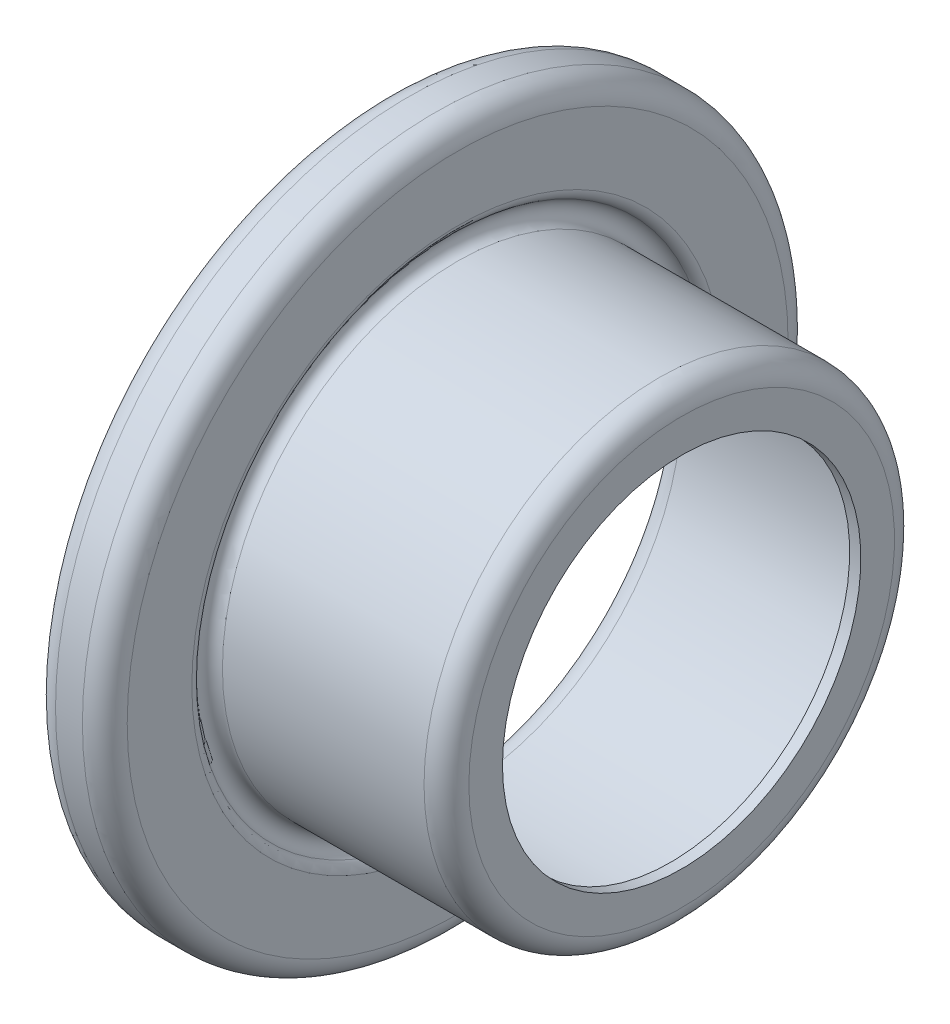
ISO-10303-21;
HEADER;
FILE_DESCRIPTION(('STEP AP214'),'2;1');
FILE_NAME('part.step','',(''),(''),'','','');
FILE_SCHEMA(('AUTOMOTIVE_DESIGN { 1 0 10303 214 1 1 1 1 }'));
ENDSEC;
DATA;
#1=APPLICATION_CONTEXT('core data for automotive mechanical design processes');
#2=APPLICATION_PROTOCOL_DEFINITION('international standard','automotive_design',2000,#1);
#3=PRODUCT_CONTEXT('',#1,'mechanical');
#4=PRODUCT('Part','Part','',(#3));
#5=PRODUCT_RELATED_PRODUCT_CATEGORY('part','',(#4));
#6=PRODUCT_DEFINITION_FORMATION('','',#4);
#7=PRODUCT_DEFINITION_CONTEXT('part definition',#1,'design');
#8=PRODUCT_DEFINITION('design','',#6,#7);
#9=PRODUCT_DEFINITION_SHAPE('','',#8);
#10=(LENGTH_UNIT() NAMED_UNIT(*) SI_UNIT(.MILLI.,.METRE.));
#11=(NAMED_UNIT(*) PLANE_ANGLE_UNIT() SI_UNIT($,.RADIAN.));
#12=(NAMED_UNIT(*) SI_UNIT($,.STERADIAN.) SOLID_ANGLE_UNIT());
#13=UNCERTAINTY_MEASURE_WITH_UNIT(LENGTH_MEASURE(1.E-05),#10,'distance_accuracy_value','');
#14=(GEOMETRIC_REPRESENTATION_CONTEXT(3) GLOBAL_UNCERTAINTY_ASSIGNED_CONTEXT((#13)) GLOBAL_UNIT_ASSIGNED_CONTEXT((#10,
#11,#12)) REPRESENTATION_CONTEXT('',''));
#15=CARTESIAN_POINT('',(0.,0.,0.));
#16=DIRECTION('',(0.,0.,1.));
#17=DIRECTION('',(1.,0.,0.));
#18=AXIS2_PLACEMENT_3D('',#15,#16,#17);
#19=CARTESIAN_POINT('',(-13.2,14.75,0.));
#20=DIRECTION('',(1.00000000000001,0.,0.));
#21=DIRECTION('',(0.,0.,-1.00000000000001));
#22=AXIS2_PLACEMENT_3D('',#19,#20,#21);
#23=PLANE('',#22);
#24=CARTESIAN_POINT('',(-13.2,0.,0.));
#25=DIRECTION('',(-1.00000000000001,0.,0.));
#26=DIRECTION('',(0.,0.,1.00000000000001));
#27=AXIS2_PLACEMENT_3D('',#24,#25,#26);
#28=CIRCLE('',#27,14.);
#29=CARTESIAN_POINT('',(-13.2,0.,14.));
#30=VERTEX_POINT('',#29);
#31=EDGE_CURVE('E10',#30,#30,#28,.T.);
#32=ORIENTED_EDGE('',*,*,#31,.F.);
#33=EDGE_LOOP('',(#32));
#34=FACE_BOUND('',#33,.T.);
#35=CARTESIAN_POINT('',(-13.2,0.,0.));
#36=DIRECTION('',(-1.00000000000001,0.,0.));
#37=DIRECTION('',(0.,0.,1.00000000000001));
#38=AXIS2_PLACEMENT_3D('',#35,#36,#37);
#39=CIRCLE('',#38,14.75);
#40=CARTESIAN_POINT('',(-13.2,0.,14.75));
#41=VERTEX_POINT('',#40);
#42=EDGE_CURVE('E115',#41,#41,#39,.T.);
#43=ORIENTED_EDGE('',*,*,#42,.T.);
#44=EDGE_LOOP('',(#43));
#45=FACE_BOUND('',#44,.T.);
#46=ADVANCED_FACE('F38',(#34,#45),#23,.F.);
#47=CARTESIAN_POINT('',(-70.0000000000004,0.,0.));
#48=DIRECTION('',(-1.00000000000001,0.,0.));
#49=DIRECTION('',(0.,0.,1.00000000000001));
#50=AXIS2_PLACEMENT_3D('',#47,#48,#49);
#51=CYLINDRICAL_SURFACE('',#50,14.);
#52=CARTESIAN_POINT('',(-12.9,0.,0.));
#53=DIRECTION('',(1.00000000000001,0.,0.));
#54=DIRECTION('',(0.,0.,-1.00000000000001));
#55=AXIS2_PLACEMENT_3D('',#52,#53,#54);
#56=CIRCLE('',#55,14.);
#57=CARTESIAN_POINT('',(-12.9,0.,-14.0000000000001));
#58=VERTEX_POINT('',#57);
#59=EDGE_CURVE('E127',#58,#58,#56,.T.);
#60=ORIENTED_EDGE('',*,*,#59,.T.);
#61=EDGE_LOOP('',(#60));
#62=FACE_BOUND('',#61,.T.);
#63=ORIENTED_EDGE('',*,*,#31,.T.);
#64=EDGE_LOOP('',(#63));
#65=FACE_BOUND('',#64,.T.);
#66=ADVANCED_FACE('F133',(#62,#65),#51,.F.);
#67=CARTESIAN_POINT('',(-70.0000000000004,0.,0.));
#68=DIRECTION('',(-1.00000000000001,0.,0.));
#69=DIRECTION('',(0.,0.,1.00000000000001));
#70=AXIS2_PLACEMENT_3D('',#67,#68,#69);
#71=CYLINDRICAL_SURFACE('',#70,15.25);
#72=CARTESIAN_POINT('',(-11.,0.,0.));
#73=DIRECTION('',(-1.00000000000001,0.,0.));
#74=DIRECTION('',(0.,0.,1.00000000000001));
#75=AXIS2_PLACEMENT_3D('',#72,#73,#74);
#76=CIRCLE('',#75,15.25);
#77=CARTESIAN_POINT('',(-11.,0.,15.25));
#78=VERTEX_POINT('',#77);
#79=EDGE_CURVE('E45',#78,#78,#76,.T.);
#80=ORIENTED_EDGE('',*,*,#79,.F.);
#81=EDGE_LOOP('',(#80));
#82=FACE_BOUND('',#81,.T.);
#83=CARTESIAN_POINT('',(-12.4,0.,0.));
#84=DIRECTION('',(1.00000000000001,0.,0.));
#85=DIRECTION('',(0.,0.,-1.00000000000001));
#86=AXIS2_PLACEMENT_3D('',#83,#84,#85);
#87=CIRCLE('',#86,15.25);
#88=CARTESIAN_POINT('',(-12.4,0.,-15.2500000000001));
#89=VERTEX_POINT('',#88);
#90=EDGE_CURVE('E119',#89,#89,#87,.T.);
#91=ORIENTED_EDGE('',*,*,#90,.F.);
#92=EDGE_LOOP('',(#91));
#93=FACE_BOUND('',#92,.T.);
#94=ADVANCED_FACE('F148',(#82,#93),#71,.F.);
#95=CARTESIAN_POINT('',(-11.,0.,0.));
#96=DIRECTION('',(-1.00000000000001,0.,0.));
#97=DIRECTION('',(0.,0.,1.00000000000001));
#98=AXIS2_PLACEMENT_3D('',#95,#96,#97);
#99=TOROIDAL_SURFACE('',#98,14.75,0.5);
#100=ORIENTED_EDGE('',*,*,#79,.T.);
#101=EDGE_LOOP('',(#100));
#102=FACE_BOUND('',#101,.T.);
#103=CARTESIAN_POINT('',(-10.5,0.,-1.52655665885959E-13));
#104=DIRECTION('',(-1.00000000000001,0.,0.));
#105=DIRECTION('',(0.,0.,1.00000000000001));
#106=AXIS2_PLACEMENT_3D('',#103,#104,#105);
#107=CIRCLE('',#106,14.75);
#108=CARTESIAN_POINT('',(-10.5,0.,14.7499999999999));
#109=VERTEX_POINT('',#108);
#110=EDGE_CURVE('E51',#109,#109,#107,.T.);
#111=ORIENTED_EDGE('',*,*,#110,.F.);
#112=EDGE_LOOP('',(#111));
#113=FACE_BOUND('',#112,.T.);
#114=ADVANCED_FACE('F150',(#102,#113),#99,.F.);
#115=CARTESIAN_POINT('',(-10.5,11.8660254037844,0.));
#116=DIRECTION('',(-1.00000000000001,0.,0.));
#117=DIRECTION('',(0.,0.,1.00000000000001));
#118=AXIS2_PLACEMENT_3D('',#115,#116,#117);
#119=PLANE('',#118);
#120=ORIENTED_EDGE('',*,*,#110,.T.);
#121=EDGE_LOOP('',(#120));
#122=FACE_BOUND('',#121,.T.);
#123=CARTESIAN_POINT('',(-10.5,0.,-1.52655665885959E-13));
#124=DIRECTION('',(-1.00000000000001,0.,0.));
#125=DIRECTION('',(0.,0.,1.00000000000001));
#126=AXIS2_PLACEMENT_3D('',#123,#124,#125);
#127=CIRCLE('',#126,11.8660254037844);
#128=CARTESIAN_POINT('',(-10.5,0.,11.8660254037843));
#129=VERTEX_POINT('',#128);
#130=EDGE_CURVE('E57',#129,#129,#127,.T.);
#131=ORIENTED_EDGE('',*,*,#130,.F.);
#132=EDGE_LOOP('',(#131));
#133=FACE_BOUND('',#132,.T.);
#134=ADVANCED_FACE('F157',(#122,#133),#119,.T.);
#135=CARTESIAN_POINT('',(-10.0000000000001,0.,-1.11022302462516E-13));
#136=DIRECTION('',(-1.00000000000001,0.,0.));
#137=DIRECTION('',(0.,0.,1.00000000000001));
#138=AXIS2_PLACEMENT_3D('',#135,#136,#137);
#139=TOROIDAL_SURFACE('',#138,11.,1.);
#140=ORIENTED_EDGE('',*,*,#130,.T.);
#141=EDGE_LOOP('',(#140));
#142=FACE_BOUND('',#141,.T.);
#143=CARTESIAN_POINT('',(-10.0000000000001,0.,-1.11022302462516E-13));
#144=DIRECTION('',(-1.00000000000001,0.,0.));
#145=DIRECTION('',(0.,0.,1.00000000000001));
#146=AXIS2_PLACEMENT_3D('',#143,#144,#145);
#147=CIRCLE('',#146,10.);
#148=CARTESIAN_POINT('',(-10.0000000000001,0.,9.99999999999994));
#149=VERTEX_POINT('',#148);
#150=EDGE_CURVE('E63',#149,#149,#147,.T.);
#151=ORIENTED_EDGE('',*,*,#150,.F.);
#152=EDGE_LOOP('',(#151));
#153=FACE_BOUND('',#152,.T.);
#154=ADVANCED_FACE('F237',(#142,#153),#139,.T.);
#155=CARTESIAN_POINT('',(-70.0000000000004,0.,0.));
#156=DIRECTION('',(-1.00000000000001,0.,0.));
#157=DIRECTION('',(0.,0.,1.00000000000001));
#158=AXIS2_PLACEMENT_3D('',#155,#156,#157);
#159=CYLINDRICAL_SURFACE('',#158,10.);
#160=ORIENTED_EDGE('',*,*,#150,.T.);
#161=EDGE_LOOP('',(#160));
#162=FACE_BOUND('',#161,.T.);
#163=CARTESIAN_POINT('',(-1.,0.,0.));
#164=DIRECTION('',(-1.00000000000001,0.,0.));
#165=DIRECTION('',(0.,0.,1.00000000000001));
#166=AXIS2_PLACEMENT_3D('',#163,#164,#165);
#167=CIRCLE('',#166,10.);
#168=CARTESIAN_POINT('',(-1.,0.,10.));
#169=VERTEX_POINT('',#168);
#170=EDGE_CURVE('E67',#169,#169,#167,.T.);
#171=ORIENTED_EDGE('',*,*,#170,.F.);
#172=EDGE_LOOP('',(#171));
#173=FACE_BOUND('',#172,.T.);
#174=ADVANCED_FACE('F233',(#162,#173),#159,.F.);
#175=CARTESIAN_POINT('',(-1.,0.,0.));
#176=DIRECTION('',(-1.00000000000001,0.,0.));
#177=DIRECTION('',(0.,0.,1.00000000000001));
#178=AXIS2_PLACEMENT_3D('',#175,#176,#177);
#179=TOROIDAL_SURFACE('',#178,9.5,0.499999999999999);
#180=ORIENTED_EDGE('',*,*,#170,.T.);
#181=EDGE_LOOP('',(#180));
#182=FACE_BOUND('',#181,.T.);
#183=CARTESIAN_POINT('',(-0.49999999999991,0.,0.));
#184=DIRECTION('',(-1.00000000000001,0.,0.));
#185=DIRECTION('',(0.,0.,1.00000000000001));
#186=AXIS2_PLACEMENT_3D('',#183,#184,#185);
#187=CIRCLE('',#186,9.5);
#188=CARTESIAN_POINT('',(-0.49999999999991,0.,9.5));
#189=VERTEX_POINT('',#188);
#190=EDGE_CURVE('E71',#189,#189,#187,.T.);
#191=ORIENTED_EDGE('',*,*,#190,.F.);
#192=EDGE_LOOP('',(#191));
#193=FACE_BOUND('',#192,.T.);
#194=ADVANCED_FACE('F227',(#182,#193),#179,.F.);
#195=CARTESIAN_POINT('',(-0.5,7.99999999999995,0.));
#196=DIRECTION('',(-1.00000000000001,0.,0.));
#197=DIRECTION('',(0.,0.,1.00000000000001));
#198=AXIS2_PLACEMENT_3D('',#195,#196,#197);
#199=PLANE('',#198);
#200=ORIENTED_EDGE('',*,*,#190,.T.);
#201=EDGE_LOOP('',(#200));
#202=FACE_BOUND('',#201,.T.);
#203=CARTESIAN_POINT('',(-0.49999999999991,0.,0.));
#204=DIRECTION('',(-1.00000000000001,0.,0.));
#205=DIRECTION('',(0.,0.,1.00000000000001));
#206=AXIS2_PLACEMENT_3D('',#203,#204,#205);
#207=CIRCLE('',#206,8.);
#208=CARTESIAN_POINT('',(-0.49999999999991,0.,7.99999999999999));
#209=VERTEX_POINT('',#208);
#210=EDGE_CURVE('E75',#209,#209,#207,.T.);
#211=ORIENTED_EDGE('',*,*,#210,.F.);
#212=EDGE_LOOP('',(#211));
#213=FACE_BOUND('',#212,.T.);
#214=ADVANCED_FACE('F221',(#202,#213),#199,.T.);
#215=CARTESIAN_POINT('',(-70.0000000000004,0.,0.));
#216=DIRECTION('',(-1.00000000000001,0.,0.));
#217=DIRECTION('',(0.,0.,1.00000000000001));
#218=AXIS2_PLACEMENT_3D('',#215,#216,#217);
#219=CYLINDRICAL_SURFACE('',#218,8.);
#220=ORIENTED_EDGE('',*,*,#210,.T.);
#221=EDGE_LOOP('',(#220));
#222=FACE_BOUND('',#221,.T.);
#223=CARTESIAN_POINT('',(0.,0.,0.));
#224=DIRECTION('',(-1.00000000000001,0.,0.));
#225=DIRECTION('',(0.,0.,1.00000000000001));
#226=AXIS2_PLACEMENT_3D('',#223,#224,#225);
#227=CIRCLE('',#226,8.);
#228=CARTESIAN_POINT('',(0.,0.,7.99999999999997));
#229=VERTEX_POINT('',#228);
#230=EDGE_CURVE('E79',#229,#229,#227,.T.);
#231=ORIENTED_EDGE('',*,*,#230,.F.);
#232=EDGE_LOOP('',(#231));
#233=FACE_BOUND('',#232,.T.);
#234=ADVANCED_FACE('F216',(#222,#233),#219,.F.);
#235=CARTESIAN_POINT('',(0.,7.99999999999998,0.));
#236=DIRECTION('',(-1.00000000000001,0.,0.));
#237=DIRECTION('',(0.,0.,1.00000000000001));
#238=AXIS2_PLACEMENT_3D('',#235,#236,#237);
#239=PLANE('',#238);
#240=CARTESIAN_POINT('',(0.,0.,0.));
#241=DIRECTION('',(-1.00000000000001,0.,0.));
#242=DIRECTION('',(0.,0.,1.00000000000001));
#243=AXIS2_PLACEMENT_3D('',#240,#241,#242);
#244=CIRCLE('',#243,9.5);
#245=CARTESIAN_POINT('',(0.,0.,9.49999999999998));
#246=VERTEX_POINT('',#245);
#247=EDGE_CURVE('E83',#246,#246,#244,.T.);
#248=ORIENTED_EDGE('',*,*,#247,.F.);
#249=EDGE_LOOP('',(#248));
#250=FACE_BOUND('',#249,.T.);
#251=ORIENTED_EDGE('',*,*,#230,.T.);
#252=EDGE_LOOP('',(#251));
#253=FACE_BOUND('',#252,.T.);
#254=ADVANCED_FACE('F210',(#250,#253),#239,.F.);
#255=CARTESIAN_POINT('',(-1.,0.,0.));
#256=DIRECTION('',(-1.00000000000001,0.,0.));
#257=DIRECTION('',(0.,0.,1.00000000000001));
#258=AXIS2_PLACEMENT_3D('',#255,#256,#257);
#259=TOROIDAL_SURFACE('',#258,9.5,0.999999999999999);
#260=CARTESIAN_POINT('',(-1.,0.,0.));
#261=DIRECTION('',(-1.00000000000001,0.,0.));
#262=DIRECTION('',(0.,0.,1.00000000000001));
#263=AXIS2_PLACEMENT_3D('',#260,#261,#262);
#264=CIRCLE('',#263,10.5);
#265=CARTESIAN_POINT('',(-1.,0.,10.5));
#266=VERTEX_POINT('',#265);
#267=EDGE_CURVE('E87',#266,#266,#264,.T.);
#268=ORIENTED_EDGE('',*,*,#267,.F.);
#269=EDGE_LOOP('',(#268));
#270=FACE_BOUND('',#269,.T.);
#271=ORIENTED_EDGE('',*,*,#247,.T.);
#272=EDGE_LOOP('',(#271));
#273=FACE_BOUND('',#272,.T.);
#274=ADVANCED_FACE('F204',(#270,#273),#259,.T.);
#275=CARTESIAN_POINT('',(-70.0000000000004,0.,0.));
#276=DIRECTION('',(-1.00000000000001,0.,0.));
#277=DIRECTION('',(0.,0.,1.00000000000001));
#278=AXIS2_PLACEMENT_3D('',#275,#276,#277);
#279=CYLINDRICAL_SURFACE('',#278,10.5);
#280=CARTESIAN_POINT('',(-10.0000000000001,0.,-1.11022302462516E-13));
#281=DIRECTION('',(-1.00000000000001,0.,0.));
#282=DIRECTION('',(0.,0.,1.00000000000001));
#283=AXIS2_PLACEMENT_3D('',#280,#281,#282);
#284=CIRCLE('',#283,10.5);
#285=CARTESIAN_POINT('',(-10.0000000000001,0.,10.4999999999999));
#286=VERTEX_POINT('',#285);
#287=EDGE_CURVE('E91',#286,#286,#284,.T.);
#288=ORIENTED_EDGE('',*,*,#287,.F.);
#289=EDGE_LOOP('',(#288));
#290=FACE_BOUND('',#289,.T.);
#291=ORIENTED_EDGE('',*,*,#267,.T.);
#292=EDGE_LOOP('',(#291));
#293=FACE_BOUND('',#292,.T.);
#294=ADVANCED_FACE('F198',(#290,#293),#279,.T.);
#295=CARTESIAN_POINT('',(-10.0000000000001,0.,-1.11022302462516E-13));
#296=DIRECTION('',(-1.00000000000001,0.,0.));
#297=DIRECTION('',(0.,0.,1.00000000000001));
#298=AXIS2_PLACEMENT_3D('',#295,#296,#297);
#299=TOROIDAL_SURFACE('',#298,11.,0.5);
#300=CARTESIAN_POINT('',(-10.25,0.,0.));
#301=DIRECTION('',(-1.00000000000001,0.,0.));
#302=DIRECTION('',(0.,0.,1.00000000000001));
#303=AXIS2_PLACEMENT_3D('',#300,#301,#302);
#304=CIRCLE('',#303,11.4330127018922);
#305=CARTESIAN_POINT('',(-10.25,0.,11.4330127018923));
#306=VERTEX_POINT('',#305);
#307=EDGE_CURVE('E95',#306,#306,#304,.T.);
#308=ORIENTED_EDGE('',*,*,#307,.F.);
#309=EDGE_LOOP('',(#308));
#310=FACE_BOUND('',#309,.T.);
#311=ORIENTED_EDGE('',*,*,#287,.T.);
#312=EDGE_LOOP('',(#311));
#313=FACE_BOUND('',#312,.T.);
#314=ADVANCED_FACE('F192',(#310,#313),#299,.F.);
#315=CARTESIAN_POINT('',(-10.5,0.,-1.52655665885959E-13));
#316=DIRECTION('',(-1.00000000000001,0.,0.));
#317=DIRECTION('',(0.,0.,1.00000000000001));
#318=AXIS2_PLACEMENT_3D('',#315,#316,#317);
#319=TOROIDAL_SURFACE('',#318,11.8660254037844,0.500000000000001);
#320=CARTESIAN_POINT('',(-10.,0.,-1.2490009027033E-13));
#321=DIRECTION('',(-1.00000000000001,0.,0.));
#322=DIRECTION('',(0.,0.,1.00000000000001));
#323=AXIS2_PLACEMENT_3D('',#320,#321,#322);
#324=CIRCLE('',#323,11.8660254037844);
#325=CARTESIAN_POINT('',(-10.,0.,11.8660254037844));
#326=VERTEX_POINT('',#325);
#327=EDGE_CURVE('E99',#326,#326,#324,.T.);
#328=ORIENTED_EDGE('',*,*,#327,.F.);
#329=EDGE_LOOP('',(#328));
#330=FACE_BOUND('',#329,.T.);
#331=ORIENTED_EDGE('',*,*,#307,.T.);
#332=EDGE_LOOP('',(#331));
#333=FACE_BOUND('',#332,.T.);
#334=ADVANCED_FACE('F186',(#330,#333),#319,.T.);
#335=CARTESIAN_POINT('',(-10.,11.8660254037844,0.));
#336=DIRECTION('',(-1.00000000000001,0.,0.));
#337=DIRECTION('',(0.,0.,1.00000000000001));
#338=AXIS2_PLACEMENT_3D('',#335,#336,#337);
#339=PLANE('',#338);
#340=CARTESIAN_POINT('',(-10.,0.,-1.2490009027033E-13));
#341=DIRECTION('',(-1.00000000000001,0.,0.));
#342=DIRECTION('',(0.,0.,1.00000000000001));
#343=AXIS2_PLACEMENT_3D('',#340,#341,#342);
#344=CIRCLE('',#343,14.75);
#345=CARTESIAN_POINT('',(-10.,0.,14.75));
#346=VERTEX_POINT('',#345);
#347=EDGE_CURVE('E103',#346,#346,#344,.T.);
#348=ORIENTED_EDGE('',*,*,#347,.F.);
#349=EDGE_LOOP('',(#348));
#350=FACE_BOUND('',#349,.T.);
#351=ORIENTED_EDGE('',*,*,#327,.T.);
#352=EDGE_LOOP('',(#351));
#353=FACE_BOUND('',#352,.T.);
#354=ADVANCED_FACE('F180',(#350,#353),#339,.F.);
#355=CARTESIAN_POINT('',(-11.,0.,0.));
#356=DIRECTION('',(-1.00000000000001,0.,0.));
#357=DIRECTION('',(0.,0.,1.00000000000001));
#358=AXIS2_PLACEMENT_3D('',#355,#356,#357);
#359=TOROIDAL_SURFACE('',#358,14.75,1.);
#360=CARTESIAN_POINT('',(-11.,0.,0.));
#361=DIRECTION('',(-1.00000000000001,0.,0.));
#362=DIRECTION('',(0.,0.,1.00000000000001));
#363=AXIS2_PLACEMENT_3D('',#360,#361,#362);
#364=CIRCLE('',#363,15.75);
#365=CARTESIAN_POINT('',(-11.,0.,15.75));
#366=VERTEX_POINT('',#365);
#367=EDGE_CURVE('E107',#366,#366,#364,.T.);
#368=ORIENTED_EDGE('',*,*,#367,.F.);
#369=EDGE_LOOP('',(#368));
#370=FACE_BOUND('',#369,.T.);
#371=ORIENTED_EDGE('',*,*,#347,.T.);
#372=EDGE_LOOP('',(#371));
#373=FACE_BOUND('',#372,.T.);
#374=ADVANCED_FACE('F174',(#370,#373),#359,.T.);
#375=CARTESIAN_POINT('',(-70.0000000000004,0.,0.));
#376=DIRECTION('',(-1.00000000000001,0.,0.));
#377=DIRECTION('',(0.,0.,1.00000000000001));
#378=AXIS2_PLACEMENT_3D('',#375,#376,#377);
#379=CYLINDRICAL_SURFACE('',#378,15.75);
#380=CARTESIAN_POINT('',(-12.2,0.,0.));
#381=DIRECTION('',(-1.00000000000001,0.,0.));
#382=DIRECTION('',(0.,0.,1.00000000000001));
#383=AXIS2_PLACEMENT_3D('',#380,#381,#382);
#384=CIRCLE('',#383,15.75);
#385=CARTESIAN_POINT('',(-12.2,0.,15.7500000000001));
#386=VERTEX_POINT('',#385);
#387=EDGE_CURVE('E111',#386,#386,#384,.T.);
#388=ORIENTED_EDGE('',*,*,#387,.F.);
#389=EDGE_LOOP('',(#388));
#390=FACE_BOUND('',#389,.T.);
#391=ORIENTED_EDGE('',*,*,#367,.T.);
#392=EDGE_LOOP('',(#391));
#393=FACE_BOUND('',#392,.T.);
#394=ADVANCED_FACE('F168',(#390,#393),#379,.T.);
#395=CARTESIAN_POINT('',(-12.2,0.,0.));
#396=DIRECTION('',(-1.00000000000001,0.,0.));
#397=DIRECTION('',(0.,0.,1.00000000000001));
#398=AXIS2_PLACEMENT_3D('',#395,#396,#397);
#399=TOROIDAL_SURFACE('',#398,14.75,1.);
#400=ORIENTED_EDGE('',*,*,#42,.F.);
#401=EDGE_LOOP('',(#400));
#402=FACE_BOUND('',#401,.T.);
#403=ORIENTED_EDGE('',*,*,#387,.T.);
#404=EDGE_LOOP('',(#403));
#405=FACE_BOUND('',#404,.T.);
#406=ADVANCED_FACE('F144',(#402,#405),#399,.T.);
#407=CARTESIAN_POINT('',(-12.4,0.,0.));
#408=DIRECTION('',(1.00000000000001,0.,0.));
#409=DIRECTION('',(0.,0.,-1.00000000000001));
#410=AXIS2_PLACEMENT_3D('',#407,#408,#409);
#411=TOROIDAL_SURFACE('',#410,14.75,0.5);
#412=CARTESIAN_POINT('',(-12.9,0.,0.));
#413=DIRECTION('',(1.00000000000001,0.,0.));
#414=DIRECTION('',(0.,0.,-1.00000000000001));
#415=AXIS2_PLACEMENT_3D('',#412,#413,#414);
#416=CIRCLE('',#415,14.75);
#417=CARTESIAN_POINT('',(-12.9,0.,-14.7500000000001));
#418=VERTEX_POINT('',#417);
#419=EDGE_CURVE('E123',#418,#418,#416,.T.);
#420=ORIENTED_EDGE('',*,*,#419,.F.);
#421=EDGE_LOOP('',(#420));
#422=FACE_BOUND('',#421,.T.);
#423=ORIENTED_EDGE('',*,*,#90,.T.);
#424=EDGE_LOOP('',(#423));
#425=FACE_BOUND('',#424,.T.);
#426=ADVANCED_FACE('F138',(#422,#425),#411,.F.);
#427=CARTESIAN_POINT('',(-12.9,14.,0.));
#428=DIRECTION('',(-1.00000000000001,0.,0.));
#429=DIRECTION('',(0.,0.,1.00000000000001));
#430=AXIS2_PLACEMENT_3D('',#427,#428,#429);
#431=PLANE('',#430);
#432=ORIENTED_EDGE('',*,*,#59,.F.);
#433=EDGE_LOOP('',(#432));
#434=FACE_BOUND('',#433,.T.);
#435=ORIENTED_EDGE('',*,*,#419,.T.);
#436=EDGE_LOOP('',(#435));
#437=FACE_BOUND('',#436,.T.);
#438=ADVANCED_FACE('F135',(#434,#437),#431,.F.);
#439=CLOSED_SHELL('',(#46,#66,#94,#114,#134,#154,#174,#194,#214,#234,#254,#274,#294,#314,#334,
#354,#374,#394,#406,#426,#438));
#440=MANIFOLD_SOLID_BREP('B2',#439);
#441=ADVANCED_BREP_SHAPE_REPRESENTATION('',(#18,#440),#14);
#442=SHAPE_DEFINITION_REPRESENTATION(#9,#441);
ENDSEC;
END-ISO-10303-21;
